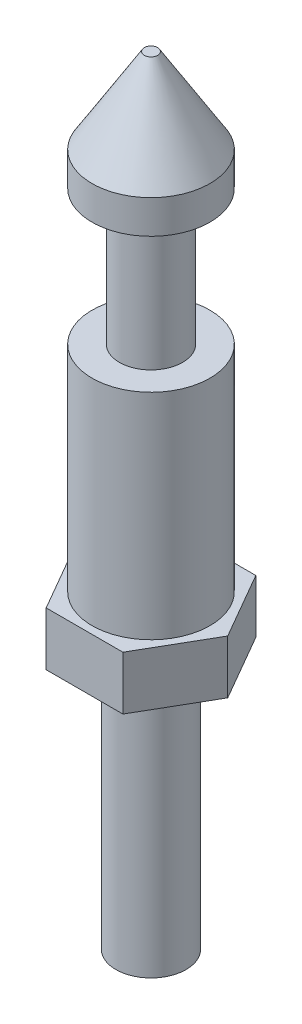
ISO-10303-21;
HEADER;
FILE_DESCRIPTION(('STEP AP214'),'2;1');
FILE_NAME('part.step','',(''),(''),'','','');
FILE_SCHEMA(('AUTOMOTIVE_DESIGN { 1 0 10303 214 1 1 1 1 }'));
ENDSEC;
DATA;
#1=APPLICATION_CONTEXT('core data for automotive mechanical design processes');
#2=APPLICATION_PROTOCOL_DEFINITION('international standard','automotive_design',2000,#1);
#3=PRODUCT_CONTEXT('',#1,'mechanical');
#4=PRODUCT('Part','Part','',(#3));
#5=PRODUCT_RELATED_PRODUCT_CATEGORY('part','',(#4));
#6=PRODUCT_DEFINITION_FORMATION('','',#4);
#7=PRODUCT_DEFINITION_CONTEXT('part definition',#1,'design');
#8=PRODUCT_DEFINITION('design','',#6,#7);
#9=PRODUCT_DEFINITION_SHAPE('','',#8);
#10=(LENGTH_UNIT() NAMED_UNIT(*) SI_UNIT(.MILLI.,.METRE.));
#11=(NAMED_UNIT(*) PLANE_ANGLE_UNIT() SI_UNIT($,.RADIAN.));
#12=(NAMED_UNIT(*) SI_UNIT($,.STERADIAN.) SOLID_ANGLE_UNIT());
#13=UNCERTAINTY_MEASURE_WITH_UNIT(LENGTH_MEASURE(1.E-05),#10,'distance_accuracy_value','');
#14=(GEOMETRIC_REPRESENTATION_CONTEXT(3) GLOBAL_UNCERTAINTY_ASSIGNED_CONTEXT((#13)) GLOBAL_UNIT_ASSIGNED_CONTEXT((#10,
#11,#12)) REPRESENTATION_CONTEXT('',''));
#15=CARTESIAN_POINT('',(0.,0.,0.));
#16=DIRECTION('',(0.,0.,1.));
#17=DIRECTION('',(1.,0.,0.));
#18=AXIS2_PLACEMENT_3D('',#15,#16,#17);
#19=CARTESIAN_POINT('',(0.,0.,0.));
#20=DIRECTION('',(0.,-1.,0.));
#21=DIRECTION('',(0.,0.,-1.));
#22=AXIS2_PLACEMENT_3D('',#19,#20,#21);
#23=CYLINDRICAL_SURFACE('',#22,2.794);
#24=CARTESIAN_POINT('',(0.,24.8412,0.));
#25=DIRECTION('',(0.,-1.,0.));
#26=DIRECTION('',(0.,0.,-1.));
#27=AXIS2_PLACEMENT_3D('',#24,#25,#26);
#28=CIRCLE('',#27,2.794);
#29=CARTESIAN_POINT('',(0.,24.8412,-2.794));
#30=VERTEX_POINT('',#29);
#31=EDGE_CURVE('E163',#30,#30,#28,.T.);
#32=ORIENTED_EDGE('',*,*,#31,.T.);
#33=EDGE_LOOP('',(#32));
#34=FACE_BOUND('',#33,.T.);
#35=CARTESIAN_POINT('',(0.,14.6812,0.));
#36=DIRECTION('',(0.,-1.,0.));
#37=DIRECTION('',(0.,0.,-1.));
#38=AXIS2_PLACEMENT_3D('',#35,#36,#37);
#39=CIRCLE('',#38,2.794);
#40=CARTESIAN_POINT('',(0.,14.6812,-2.794));
#41=VERTEX_POINT('',#40);
#42=EDGE_CURVE('E41',#41,#41,#39,.F.);
#43=ORIENTED_EDGE('',*,*,#42,.T.);
#44=EDGE_LOOP('',(#43));
#45=FACE_BOUND('',#44,.T.);
#46=ADVANCED_FACE('F37',(#34,#45),#23,.T.);
#47=CARTESIAN_POINT('',(2.794,24.8412,0.));
#48=DIRECTION('',(0.,1.,0.));
#49=DIRECTION('',(0.,0.,1.));
#50=AXIS2_PLACEMENT_3D('',#47,#48,#49);
#51=PLANE('',#50);
#52=CARTESIAN_POINT('',(0.,24.8412,0.));
#53=DIRECTION('',(0.,-1.,0.));
#54=DIRECTION('',(0.,0.,-1.));
#55=AXIS2_PLACEMENT_3D('',#52,#53,#54);
#56=CIRCLE('',#55,1.4986);
#57=CARTESIAN_POINT('',(0.,24.8412,-1.4986));
#58=VERTEX_POINT('',#57);
#59=EDGE_CURVE('E160',#58,#58,#56,.T.);
#60=ORIENTED_EDGE('',*,*,#59,.T.);
#61=EDGE_LOOP('',(#60));
#62=FACE_BOUND('',#61,.T.);
#63=ORIENTED_EDGE('',*,*,#31,.F.);
#64=EDGE_LOOP('',(#63));
#65=FACE_BOUND('',#64,.T.);
#66=ADVANCED_FACE('F193',(#62,#65),#51,.T.);
#67=CARTESIAN_POINT('',(0.,0.,0.));
#68=DIRECTION('',(0.,-1.,0.));
#69=DIRECTION('',(0.,0.,-1.));
#70=AXIS2_PLACEMENT_3D('',#67,#68,#69);
#71=CYLINDRICAL_SURFACE('',#70,1.4986);
#72=CARTESIAN_POINT('',(0.,31.242,0.));
#73=DIRECTION('',(0.,-1.,0.));
#74=DIRECTION('',(0.,0.,-1.));
#75=AXIS2_PLACEMENT_3D('',#72,#73,#74);
#76=CIRCLE('',#75,1.4986);
#77=CARTESIAN_POINT('',(0.,31.242,-1.4986));
#78=VERTEX_POINT('',#77);
#79=EDGE_CURVE('E157',#78,#78,#76,.T.);
#80=ORIENTED_EDGE('',*,*,#79,.T.);
#81=EDGE_LOOP('',(#80));
#82=FACE_BOUND('',#81,.T.);
#83=ORIENTED_EDGE('',*,*,#59,.F.);
#84=EDGE_LOOP('',(#83));
#85=FACE_BOUND('',#84,.T.);
#86=ADVANCED_FACE('F199',(#82,#85),#71,.T.);
#87=CARTESIAN_POINT('',(1.4986,31.242,0.));
#88=DIRECTION('',(0.,-1.,0.));
#89=DIRECTION('',(0.,0.,-1.));
#90=AXIS2_PLACEMENT_3D('',#87,#88,#89);
#91=PLANE('',#90);
#92=CARTESIAN_POINT('',(0.,31.242,0.));
#93=DIRECTION('',(0.,-1.,0.));
#94=DIRECTION('',(0.,0.,-1.));
#95=AXIS2_PLACEMENT_3D('',#92,#93,#94);
#96=CIRCLE('',#95,2.794);
#97=CARTESIAN_POINT('',(0.,31.242,-2.794));
#98=VERTEX_POINT('',#97);
#99=EDGE_CURVE('E154',#98,#98,#96,.T.);
#100=ORIENTED_EDGE('',*,*,#99,.T.);
#101=EDGE_LOOP('',(#100));
#102=FACE_BOUND('',#101,.T.);
#103=ORIENTED_EDGE('',*,*,#79,.F.);
#104=EDGE_LOOP('',(#103));
#105=FACE_BOUND('',#104,.T.);
#106=ADVANCED_FACE('F236',(#102,#105),#91,.T.);
#107=CARTESIAN_POINT('',(0.,0.,0.));
#108=DIRECTION('',(0.,-1.,0.));
#109=DIRECTION('',(0.,0.,-1.));
#110=AXIS2_PLACEMENT_3D('',#107,#108,#109);
#111=CYLINDRICAL_SURFACE('',#110,2.794);
#112=CARTESIAN_POINT('',(0.,32.8295,0.));
#113=DIRECTION('',(0.,-1.,0.));
#114=DIRECTION('',(0.,0.,-1.));
#115=AXIS2_PLACEMENT_3D('',#112,#113,#114);
#116=CIRCLE('',#115,2.794);
#117=CARTESIAN_POINT('',(0.,32.8295,-2.794));
#118=VERTEX_POINT('',#117);
#119=EDGE_CURVE('E151',#118,#118,#116,.T.);
#120=ORIENTED_EDGE('',*,*,#119,.T.);
#121=EDGE_LOOP('',(#120));
#122=FACE_BOUND('',#121,.T.);
#123=ORIENTED_EDGE('',*,*,#99,.F.);
#124=EDGE_LOOP('',(#123));
#125=FACE_BOUND('',#124,.T.);
#126=ADVANCED_FACE('F232',(#122,#125),#111,.T.);
#127=CARTESIAN_POINT('',(0.,32.8295,0.));
#128=DIRECTION('',(0.,-1.,0.));
#129=DIRECTION('',(0.,0.,-1.));
#130=AXIS2_PLACEMENT_3D('',#127,#128,#129);
#131=CONICAL_SURFACE('',#130,2.794,0.551478957182715);
#132=CARTESIAN_POINT('',(0.,36.8554,0.));
#133=DIRECTION('',(0.,-1.,0.));
#134=DIRECTION('',(0.,0.,-1.));
#135=AXIS2_PLACEMENT_3D('',#132,#133,#134);
#136=CIRCLE('',#135,0.3175);
#137=CARTESIAN_POINT('',(0.,36.8554,-0.3175));
#138=VERTEX_POINT('',#137);
#139=EDGE_CURVE('E148',#138,#138,#136,.T.);
#140=ORIENTED_EDGE('',*,*,#139,.T.);
#141=EDGE_LOOP('',(#140));
#142=FACE_BOUND('',#141,.T.);
#143=ORIENTED_EDGE('',*,*,#119,.F.);
#144=EDGE_LOOP('',(#143));
#145=FACE_BOUND('',#144,.T.);
#146=ADVANCED_FACE('F228',(#142,#145),#131,.T.);
#147=CARTESIAN_POINT('',(0.3175,36.8554,0.));
#148=DIRECTION('',(0.,1.,0.));
#149=DIRECTION('',(0.,0.,1.));
#150=AXIS2_PLACEMENT_3D('',#147,#148,#149);
#151=PLANE('',#150);
#152=ORIENTED_EDGE('',*,*,#139,.F.);
#153=EDGE_LOOP('',(#152));
#154=FACE_BOUND('',#153,.T.);
#155=ADVANCED_FACE('F189',(#154),#151,.T.);
#156=CARTESIAN_POINT('',(1.81842240783965,14.6812,-3.1496));
#157=DIRECTION('',(0.866025403784439,0.,-0.5));
#158=DIRECTION('',(-0.5,0.,-0.866025403784439));
#159=AXIS2_PLACEMENT_3D('',#156,#157,#158);
#160=PLANE('',#159);
#161=DIRECTION('',(0.5,0.,0.866025403784439));
#162=VECTOR('',#161,1.);
#163=CARTESIAN_POINT('',(1.81842240783965,12.1412,-3.1496));
#164=LINE('',#163,#162);
#165=CARTESIAN_POINT('',(1.81842240783965,12.1412,-3.1496));
#166=VERTEX_POINT('',#165);
#167=CARTESIAN_POINT('',(3.63684481567929,12.1412,0.));
#168=VERTEX_POINT('',#167);
#169=EDGE_CURVE('E126',#166,#168,#164,.T.);
#170=ORIENTED_EDGE('',*,*,#169,.F.);
#171=DIRECTION('',(0.,-1.,0.));
#172=VECTOR('',#171,1.);
#173=CARTESIAN_POINT('',(1.81842240783965,14.6812,-3.1496));
#174=LINE('',#173,#172);
#175=CARTESIAN_POINT('',(1.81842240783965,14.6812,-3.1496));
#176=VERTEX_POINT('',#175);
#177=EDGE_CURVE('E55',#176,#166,#174,.T.);
#178=ORIENTED_EDGE('',*,*,#177,.F.);
#179=DIRECTION('',(0.5,0.,0.866025403784439));
#180=VECTOR('',#179,1.);
#181=CARTESIAN_POINT('',(1.81842240783965,14.6812,-3.1496));
#182=LINE('',#181,#180);
#183=CARTESIAN_POINT('',(3.63684481567929,14.6812,0.));
#184=VERTEX_POINT('',#183);
#185=EDGE_CURVE('E141',#176,#184,#182,.T.);
#186=ORIENTED_EDGE('',*,*,#185,.T.);
#187=DIRECTION('',(0.,-1.,0.));
#188=VECTOR('',#187,1.);
#189=CARTESIAN_POINT('',(3.63684481567929,14.6812,0.));
#190=LINE('',#189,#188);
#191=EDGE_CURVE('E90',#184,#168,#190,.T.);
#192=ORIENTED_EDGE('',*,*,#191,.T.);
#193=EDGE_LOOP('',(#170,#178,#186,#192));
#194=FACE_BOUND('',#193,.T.);
#195=ADVANCED_FACE('F176',(#194),#160,.T.);
#196=CARTESIAN_POINT('',(-1.81842240783965,14.6812,-3.1496));
#197=DIRECTION('',(0.,0.,-1.));
#198=DIRECTION('',(-1.,0.,0.));
#199=AXIS2_PLACEMENT_3D('',#196,#197,#198);
#200=PLANE('',#199);
#201=DIRECTION('',(1.,0.,0.));
#202=VECTOR('',#201,1.);
#203=CARTESIAN_POINT('',(-1.81842240783965,12.1412,-3.1496));
#204=LINE('',#203,#202);
#205=CARTESIAN_POINT('',(-1.81842240783965,12.1412,-3.1496));
#206=VERTEX_POINT('',#205);
#207=EDGE_CURVE('E138',#206,#166,#204,.T.);
#208=ORIENTED_EDGE('',*,*,#207,.F.);
#209=DIRECTION('',(0.,-1.,0.));
#210=VECTOR('',#209,1.);
#211=CARTESIAN_POINT('',(-1.81842240783965,14.6812,-3.1496));
#212=LINE('',#211,#210);
#213=CARTESIAN_POINT('',(-1.81842240783965,14.6812,-3.1496));
#214=VERTEX_POINT('',#213);
#215=EDGE_CURVE('E78',#214,#206,#212,.T.);
#216=ORIENTED_EDGE('',*,*,#215,.F.);
#217=DIRECTION('',(1.,0.,0.));
#218=VECTOR('',#217,1.);
#219=CARTESIAN_POINT('',(-1.81842240783965,14.6812,-3.1496));
#220=LINE('',#219,#218);
#221=EDGE_CURVE('E116',#214,#176,#220,.T.);
#222=ORIENTED_EDGE('',*,*,#221,.T.);
#223=ORIENTED_EDGE('',*,*,#177,.T.);
#224=EDGE_LOOP('',(#208,#216,#222,#223));
#225=FACE_BOUND('',#224,.T.);
#226=ADVANCED_FACE('F181',(#225),#200,.T.);
#227=CARTESIAN_POINT('',(-3.63684481567929,14.6812,0.));
#228=DIRECTION('',(-0.866025403784439,0.,-0.5));
#229=DIRECTION('',(-0.5,0.,0.866025403784439));
#230=AXIS2_PLACEMENT_3D('',#227,#228,#229);
#231=PLANE('',#230);
#232=DIRECTION('',(0.5,0.,-0.866025403784439));
#233=VECTOR('',#232,1.);
#234=CARTESIAN_POINT('',(-3.63684481567929,12.1412,0.));
#235=LINE('',#234,#233);
#236=CARTESIAN_POINT('',(-3.63684481567929,12.1412,0.));
#237=VERTEX_POINT('',#236);
#238=EDGE_CURVE('E103',#237,#206,#235,.T.);
#239=ORIENTED_EDGE('',*,*,#238,.F.);
#240=DIRECTION('',(0.,-1.,0.));
#241=VECTOR('',#240,1.);
#242=CARTESIAN_POINT('',(-3.63684481567929,14.6812,0.));
#243=LINE('',#242,#241);
#244=CARTESIAN_POINT('',(-3.63684481567929,14.6812,0.));
#245=VERTEX_POINT('',#244);
#246=EDGE_CURVE('E98',#245,#237,#243,.T.);
#247=ORIENTED_EDGE('',*,*,#246,.F.);
#248=DIRECTION('',(0.5,0.,-0.866025403784439));
#249=VECTOR('',#248,1.);
#250=CARTESIAN_POINT('',(-3.63684481567929,14.6812,0.));
#251=LINE('',#250,#249);
#252=EDGE_CURVE('E101',#245,#214,#251,.T.);
#253=ORIENTED_EDGE('',*,*,#252,.T.);
#254=ORIENTED_EDGE('',*,*,#215,.T.);
#255=EDGE_LOOP('',(#239,#247,#253,#254));
#256=FACE_BOUND('',#255,.T.);
#257=ADVANCED_FACE('F100',(#256),#231,.T.);
#258=CARTESIAN_POINT('',(-1.81842240783965,14.6812,3.1496));
#259=DIRECTION('',(-0.866025403784439,0.,0.5));
#260=DIRECTION('',(0.5,0.,0.866025403784439));
#261=AXIS2_PLACEMENT_3D('',#258,#259,#260);
#262=PLANE('',#261);
#263=DIRECTION('',(-0.5,0.,-0.866025403784439));
#264=VECTOR('',#263,1.);
#265=CARTESIAN_POINT('',(-1.81842240783965,12.1412,3.1496));
#266=LINE('',#265,#264);
#267=CARTESIAN_POINT('',(-1.81842240783965,12.1412,3.1496));
#268=VERTEX_POINT('',#267);
#269=EDGE_CURVE('E135',#268,#237,#266,.T.);
#270=ORIENTED_EDGE('',*,*,#269,.F.);
#271=DIRECTION('',(0.,-1.,0.));
#272=VECTOR('',#271,1.);
#273=CARTESIAN_POINT('',(-1.81842240783965,14.6812,3.1496));
#274=LINE('',#273,#272);
#275=CARTESIAN_POINT('',(-1.81842240783965,14.6812,3.1496));
#276=VERTEX_POINT('',#275);
#277=EDGE_CURVE('E108',#276,#268,#274,.T.);
#278=ORIENTED_EDGE('',*,*,#277,.F.);
#279=DIRECTION('',(-0.5,0.,-0.866025403784439));
#280=VECTOR('',#279,1.);
#281=CARTESIAN_POINT('',(-1.81842240783965,14.6812,3.1496));
#282=LINE('',#281,#280);
#283=EDGE_CURVE('E114',#276,#245,#282,.T.);
#284=ORIENTED_EDGE('',*,*,#283,.T.);
#285=ORIENTED_EDGE('',*,*,#246,.T.);
#286=EDGE_LOOP('',(#270,#278,#284,#285));
#287=FACE_BOUND('',#286,.T.);
#288=ADVANCED_FACE('F118',(#287),#262,.T.);
#289=CARTESIAN_POINT('',(1.81842240783964,14.6812,3.1496));
#290=DIRECTION('',(0.,0.,1.));
#291=DIRECTION('',(1.,0.,0.));
#292=AXIS2_PLACEMENT_3D('',#289,#290,#291);
#293=PLANE('',#292);
#294=DIRECTION('',(-1.,0.,0.));
#295=VECTOR('',#294,1.);
#296=CARTESIAN_POINT('',(1.81842240783964,12.1412,3.1496));
#297=LINE('',#296,#295);
#298=CARTESIAN_POINT('',(1.81842240783964,12.1412,3.1496));
#299=VERTEX_POINT('',#298);
#300=EDGE_CURVE('E132',#299,#268,#297,.T.);
#301=ORIENTED_EDGE('',*,*,#300,.F.);
#302=DIRECTION('',(0.,-1.,0.));
#303=VECTOR('',#302,1.);
#304=CARTESIAN_POINT('',(1.81842240783964,14.6812,3.1496));
#305=LINE('',#304,#303);
#306=CARTESIAN_POINT('',(1.81842240783964,14.6812,3.1496));
#307=VERTEX_POINT('',#306);
#308=EDGE_CURVE('E145',#307,#299,#305,.T.);
#309=ORIENTED_EDGE('',*,*,#308,.F.);
#310=DIRECTION('',(-1.,0.,0.));
#311=VECTOR('',#310,1.);
#312=CARTESIAN_POINT('',(1.81842240783964,14.6812,3.1496));
#313=LINE('',#312,#311);
#314=EDGE_CURVE('E119',#307,#276,#313,.T.);
#315=ORIENTED_EDGE('',*,*,#314,.T.);
#316=ORIENTED_EDGE('',*,*,#277,.T.);
#317=EDGE_LOOP('',(#301,#309,#315,#316));
#318=FACE_BOUND('',#317,.T.);
#319=ADVANCED_FACE('F180',(#318),#293,.T.);
#320=CARTESIAN_POINT('',(3.63684481567929,14.6812,0.));
#321=DIRECTION('',(0.866025403784439,0.,0.5));
#322=DIRECTION('',(0.5,0.,-0.866025403784439));
#323=AXIS2_PLACEMENT_3D('',#320,#321,#322);
#324=PLANE('',#323);
#325=DIRECTION('',(-0.5,0.,0.866025403784439));
#326=VECTOR('',#325,1.);
#327=CARTESIAN_POINT('',(3.63684481567929,12.1412,0.));
#328=LINE('',#327,#326);
#329=EDGE_CURVE('E129',#168,#299,#328,.T.);
#330=ORIENTED_EDGE('',*,*,#329,.F.);
#331=ORIENTED_EDGE('',*,*,#191,.F.);
#332=DIRECTION('',(-0.5,0.,0.866025403784439));
#333=VECTOR('',#332,1.);
#334=CARTESIAN_POINT('',(3.63684481567929,14.6812,0.));
#335=LINE('',#334,#333);
#336=EDGE_CURVE('E121',#184,#307,#335,.T.);
#337=ORIENTED_EDGE('',*,*,#336,.T.);
#338=ORIENTED_EDGE('',*,*,#308,.T.);
#339=EDGE_LOOP('',(#330,#331,#337,#338));
#340=FACE_BOUND('',#339,.T.);
#341=ADVANCED_FACE('F177',(#340),#324,.T.);
#342=CARTESIAN_POINT('',(0.,14.6812,0.));
#343=DIRECTION('',(0.,-1.,0.));
#344=DIRECTION('',(0.,0.,-1.));
#345=AXIS2_PLACEMENT_3D('',#342,#343,#344);
#346=PLANE('',#345);
#347=ORIENTED_EDGE('',*,*,#42,.F.);
#348=EDGE_LOOP('',(#347));
#349=FACE_BOUND('',#348,.T.);
#350=ORIENTED_EDGE('',*,*,#185,.F.);
#351=ORIENTED_EDGE('',*,*,#221,.F.);
#352=ORIENTED_EDGE('',*,*,#252,.F.);
#353=ORIENTED_EDGE('',*,*,#283,.F.);
#354=ORIENTED_EDGE('',*,*,#314,.F.);
#355=ORIENTED_EDGE('',*,*,#336,.F.);
#356=EDGE_LOOP('',(#350,#351,#352,#353,#354,#355));
#357=FACE_BOUND('',#356,.T.);
#358=ADVANCED_FACE('F112',(#349,#357),#346,.F.);
#359=CARTESIAN_POINT('',(0.,0.,0.));
#360=DIRECTION('',(0.,-1.,0.));
#361=DIRECTION('',(0.,0.,-1.));
#362=AXIS2_PLACEMENT_3D('',#359,#360,#361);
#363=PLANE('',#362);
#364=CARTESIAN_POINT('',(0.,0.,0.));
#365=DIRECTION('',(0.,-1.,0.));
#366=DIRECTION('',(0.,0.,-1.));
#367=AXIS2_PLACEMENT_3D('',#364,#365,#366);
#368=CIRCLE('',#367,1.6637);
#369=CARTESIAN_POINT('',(0.,0.,-1.6637));
#370=VERTEX_POINT('',#369);
#371=EDGE_CURVE('E11',#370,#370,#368,.T.);
#372=ORIENTED_EDGE('',*,*,#371,.T.);
#373=EDGE_LOOP('',(#372));
#374=FACE_BOUND('',#373,.T.);
#375=ADVANCED_FACE('F39',(#374),#363,.T.);
#376=CARTESIAN_POINT('',(0.,0.,0.));
#377=DIRECTION('',(0.,-1.,0.));
#378=DIRECTION('',(0.,0.,-1.));
#379=AXIS2_PLACEMENT_3D('',#376,#377,#378);
#380=CYLINDRICAL_SURFACE('',#379,1.6637);
#381=CARTESIAN_POINT('',(0.,12.1412,0.));
#382=DIRECTION('',(0.,-1.,0.));
#383=DIRECTION('',(0.,0.,-1.));
#384=AXIS2_PLACEMENT_3D('',#381,#382,#383);
#385=CIRCLE('',#384,1.6637);
#386=CARTESIAN_POINT('',(0.,12.1412,-1.6637));
#387=VERTEX_POINT('',#386);
#388=EDGE_CURVE('E47',#387,#387,#385,.T.);
#389=ORIENTED_EDGE('',*,*,#388,.T.);
#390=EDGE_LOOP('',(#389));
#391=FACE_BOUND('',#390,.T.);
#392=ORIENTED_EDGE('',*,*,#371,.F.);
#393=EDGE_LOOP('',(#392));
#394=FACE_BOUND('',#393,.T.);
#395=ADVANCED_FACE('F169',(#391,#394),#380,.T.);
#396=CARTESIAN_POINT('',(1.6637,12.1412,0.));
#397=DIRECTION('',(0.,-1.,0.));
#398=DIRECTION('',(0.,0.,-1.));
#399=AXIS2_PLACEMENT_3D('',#396,#397,#398);
#400=PLANE('',#399);
#401=ORIENTED_EDGE('',*,*,#388,.F.);
#402=EDGE_LOOP('',(#401));
#403=FACE_BOUND('',#402,.T.);
#404=ORIENTED_EDGE('',*,*,#169,.T.);
#405=ORIENTED_EDGE('',*,*,#329,.T.);
#406=ORIENTED_EDGE('',*,*,#300,.T.);
#407=ORIENTED_EDGE('',*,*,#269,.T.);
#408=ORIENTED_EDGE('',*,*,#238,.T.);
#409=ORIENTED_EDGE('',*,*,#207,.T.);
#410=EDGE_LOOP('',(#404,#405,#406,#407,#408,#409));
#411=FACE_BOUND('',#410,.T.);
#412=ADVANCED_FACE('F172',(#403,#411),#400,.T.);
#413=CLOSED_SHELL('',(#46,#66,#86,#106,#126,#146,#155,#195,#226,#257,#288,#319,#341,#358,#375,
#395,#412));
#414=MANIFOLD_SOLID_BREP('B2',#413);
#415=ADVANCED_BREP_SHAPE_REPRESENTATION('',(#18,#414),#14);
#416=SHAPE_DEFINITION_REPRESENTATION(#9,#415);
ENDSEC;
END-ISO-10303-21;
